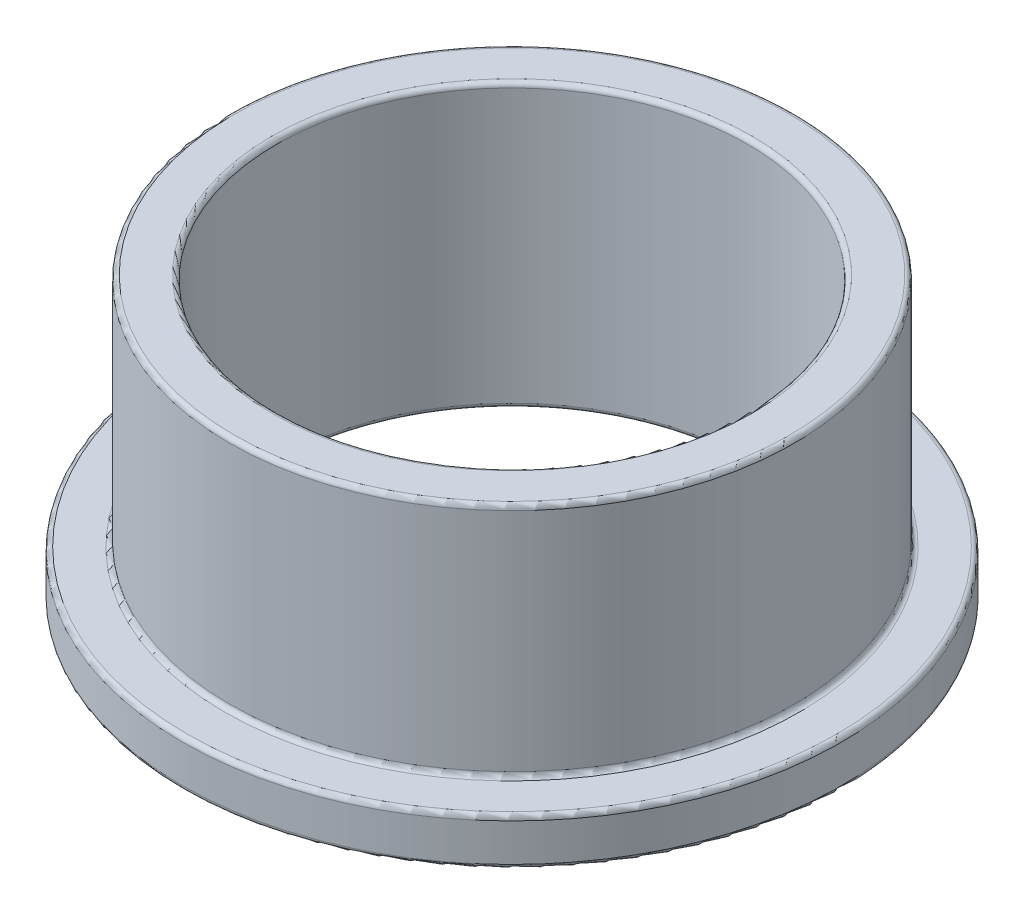
ISO-10303-21;
HEADER;
FILE_DESCRIPTION(('STEP AP214'),'2;1');
FILE_NAME('part.step','',(''),(''),'','','');
FILE_SCHEMA(('AUTOMOTIVE_DESIGN { 1 0 10303 214 1 1 1 1 }'));
ENDSEC;
DATA;
#1=APPLICATION_CONTEXT('core data for automotive mechanical design processes');
#2=APPLICATION_PROTOCOL_DEFINITION('international standard','automotive_design',2000,#1);
#3=PRODUCT_CONTEXT('',#1,'mechanical');
#4=PRODUCT('Part','Part','',(#3));
#5=PRODUCT_RELATED_PRODUCT_CATEGORY('part','',(#4));
#6=PRODUCT_DEFINITION_FORMATION('','',#4);
#7=PRODUCT_DEFINITION_CONTEXT('part definition',#1,'design');
#8=PRODUCT_DEFINITION('design','',#6,#7);
#9=PRODUCT_DEFINITION_SHAPE('','',#8);
#10=(LENGTH_UNIT() NAMED_UNIT(*) SI_UNIT(.MILLI.,.METRE.));
#11=(NAMED_UNIT(*) PLANE_ANGLE_UNIT() SI_UNIT($,.RADIAN.));
#12=(NAMED_UNIT(*) SI_UNIT($,.STERADIAN.) SOLID_ANGLE_UNIT());
#13=UNCERTAINTY_MEASURE_WITH_UNIT(LENGTH_MEASURE(1.E-05),#10,'distance_accuracy_value','');
#14=(GEOMETRIC_REPRESENTATION_CONTEXT(3) GLOBAL_UNCERTAINTY_ASSIGNED_CONTEXT((#13)) GLOBAL_UNIT_ASSIGNED_CONTEXT((#10,
#11,#12)) REPRESENTATION_CONTEXT('',''));
#15=CARTESIAN_POINT('',(0.,0.,0.));
#16=DIRECTION('',(0.,0.,1.));
#17=DIRECTION('',(1.,0.,0.));
#18=AXIS2_PLACEMENT_3D('',#15,#16,#17);
#19=CARTESIAN_POINT('',(0.,6.,0.));
#20=DIRECTION('',(0.,1.,0.));
#21=DIRECTION('',(0.,0.,1.));
#22=AXIS2_PLACEMENT_3D('',#19,#20,#21);
#23=PLANE('',#22);
#24=CARTESIAN_POINT('',(0.,6.,0.));
#25=DIRECTION('',(0.,1.,0.));
#26=DIRECTION('',(0.,0.,1.));
#27=AXIS2_PLACEMENT_3D('',#24,#25,#26);
#28=CIRCLE('',#27,5.1);
#29=CARTESIAN_POINT('',(0.,6.,5.1));
#30=VERTEX_POINT('',#29);
#31=EDGE_CURVE('E10',#30,#30,#28,.F.);
#32=ORIENTED_EDGE('',*,*,#31,.T.);
#33=EDGE_LOOP('',(#32));
#34=FACE_BOUND('',#33,.T.);
#35=CARTESIAN_POINT('',(0.,6.,0.));
#36=DIRECTION('',(0.,1.,0.));
#37=DIRECTION('',(0.,0.,1.));
#38=AXIS2_PLACEMENT_3D('',#35,#36,#37);
#39=CIRCLE('',#38,5.9);
#40=CARTESIAN_POINT('',(0.,6.,5.9));
#41=VERTEX_POINT('',#40);
#42=EDGE_CURVE('E42',#41,#41,#39,.T.);
#43=ORIENTED_EDGE('',*,*,#42,.T.);
#44=EDGE_LOOP('',(#43));
#45=FACE_BOUND('',#44,.T.);
#46=ADVANCED_FACE('F35',(#34,#45),#23,.T.);
#47=CARTESIAN_POINT('',(0.,0.,0.));
#48=DIRECTION('',(0.,1.,0.));
#49=DIRECTION('',(0.,0.,1.));
#50=AXIS2_PLACEMENT_3D('',#47,#48,#49);
#51=PLANE('',#50);
#52=CARTESIAN_POINT('',(0.,0.,0.));
#53=DIRECTION('',(0.,1.,0.));
#54=DIRECTION('',(0.,0.,1.));
#55=AXIS2_PLACEMENT_3D('',#52,#53,#54);
#56=CIRCLE('',#55,5.1);
#57=CARTESIAN_POINT('',(0.,0.,5.1));
#58=VERTEX_POINT('',#57);
#59=EDGE_CURVE('E73',#58,#58,#56,.T.);
#60=ORIENTED_EDGE('',*,*,#59,.T.);
#61=EDGE_LOOP('',(#60));
#62=FACE_BOUND('',#61,.T.);
#63=CARTESIAN_POINT('',(0.,0.,0.));
#64=DIRECTION('',(0.,1.,0.));
#65=DIRECTION('',(0.,0.,1.));
#66=AXIS2_PLACEMENT_3D('',#63,#64,#65);
#67=CIRCLE('',#66,6.9);
#68=CARTESIAN_POINT('',(0.,0.,6.9));
#69=VERTEX_POINT('',#68);
#70=EDGE_CURVE('E76',#69,#69,#67,.F.);
#71=ORIENTED_EDGE('',*,*,#70,.T.);
#72=EDGE_LOOP('',(#71));
#73=FACE_BOUND('',#72,.T.);
#74=ADVANCED_FACE('F80',(#62,#73),#51,.F.);
#75=CARTESIAN_POINT('',(0.,6.,0.));
#76=DIRECTION('',(0.,-1.,0.));
#77=DIRECTION('',(0.,0.,-1.));
#78=AXIS2_PLACEMENT_3D('',#75,#76,#77);
#79=CYLINDRICAL_SURFACE('',#78,6.);
#80=CARTESIAN_POINT('',(0.,1.1,0.));
#81=DIRECTION('',(0.,1.,0.));
#82=DIRECTION('',(0.,0.,1.));
#83=AXIS2_PLACEMENT_3D('',#80,#81,#82);
#84=CIRCLE('',#83,6.);
#85=CARTESIAN_POINT('',(0.,1.1,6.));
#86=VERTEX_POINT('',#85);
#87=EDGE_CURVE('E55',#86,#86,#84,.T.);
#88=ORIENTED_EDGE('',*,*,#87,.T.);
#89=EDGE_LOOP('',(#88));
#90=FACE_BOUND('',#89,.T.);
#91=CARTESIAN_POINT('',(0.,5.9,0.));
#92=DIRECTION('',(0.,1.,0.));
#93=DIRECTION('',(0.,0.,1.));
#94=AXIS2_PLACEMENT_3D('',#91,#92,#93);
#95=CIRCLE('',#94,6.);
#96=CARTESIAN_POINT('',(0.,5.9,6.));
#97=VERTEX_POINT('',#96);
#98=EDGE_CURVE('E58',#97,#97,#95,.F.);
#99=ORIENTED_EDGE('',*,*,#98,.T.);
#100=EDGE_LOOP('',(#99));
#101=FACE_BOUND('',#100,.T.);
#102=ADVANCED_FACE('F111',(#90,#101),#79,.T.);
#103=CARTESIAN_POINT('',(0.,6.,0.));
#104=DIRECTION('',(0.,-1.,0.));
#105=DIRECTION('',(0.,0.,-1.));
#106=AXIS2_PLACEMENT_3D('',#103,#104,#105);
#107=CYLINDRICAL_SURFACE('',#106,5.);
#108=CARTESIAN_POINT('',(0.,0.1,0.));
#109=DIRECTION('',(0.,1.,0.));
#110=DIRECTION('',(0.,0.,1.));
#111=AXIS2_PLACEMENT_3D('',#108,#109,#110);
#112=CIRCLE('',#111,5.);
#113=CARTESIAN_POINT('',(0.,0.1,5.));
#114=VERTEX_POINT('',#113);
#115=EDGE_CURVE('E67',#114,#114,#112,.F.);
#116=ORIENTED_EDGE('',*,*,#115,.T.);
#117=EDGE_LOOP('',(#116));
#118=FACE_BOUND('',#117,.T.);
#119=CARTESIAN_POINT('',(0.,5.9,0.));
#120=DIRECTION('',(0.,1.,0.));
#121=DIRECTION('',(0.,0.,1.));
#122=AXIS2_PLACEMENT_3D('',#119,#120,#121);
#123=CIRCLE('',#122,5.);
#124=CARTESIAN_POINT('',(0.,5.9,5.));
#125=VERTEX_POINT('',#124);
#126=EDGE_CURVE('E70',#125,#125,#123,.T.);
#127=ORIENTED_EDGE('',*,*,#126,.T.);
#128=EDGE_LOOP('',(#127));
#129=FACE_BOUND('',#128,.T.);
#130=ADVANCED_FACE('F105',(#118,#129),#107,.F.);
#131=CARTESIAN_POINT('',(0.,1.,0.));
#132=DIRECTION('',(0.,1.,0.));
#133=DIRECTION('',(0.,0.,1.));
#134=AXIS2_PLACEMENT_3D('',#131,#132,#133);
#135=PLANE('',#134);
#136=CARTESIAN_POINT('',(0.,1.,0.));
#137=DIRECTION('',(0.,1.,0.));
#138=DIRECTION('',(0.,0.,1.));
#139=AXIS2_PLACEMENT_3D('',#136,#137,#138);
#140=CIRCLE('',#139,6.1);
#141=CARTESIAN_POINT('',(0.,1.,6.1));
#142=VERTEX_POINT('',#141);
#143=EDGE_CURVE('E46',#142,#142,#140,.F.);
#144=ORIENTED_EDGE('',*,*,#143,.T.);
#145=EDGE_LOOP('',(#144));
#146=FACE_BOUND('',#145,.T.);
#147=CARTESIAN_POINT('',(0.,1.,0.));
#148=DIRECTION('',(0.,1.,0.));
#149=DIRECTION('',(0.,0.,1.));
#150=AXIS2_PLACEMENT_3D('',#147,#148,#149);
#151=CIRCLE('',#150,6.9);
#152=CARTESIAN_POINT('',(0.,1.,6.9));
#153=VERTEX_POINT('',#152);
#154=EDGE_CURVE('E50',#153,#153,#151,.T.);
#155=ORIENTED_EDGE('',*,*,#154,.T.);
#156=EDGE_LOOP('',(#155));
#157=FACE_BOUND('',#156,.T.);
#158=ADVANCED_FACE('F93',(#146,#157),#135,.T.);
#159=CARTESIAN_POINT('',(0.,1.,0.));
#160=DIRECTION('',(0.,-1.,0.));
#161=DIRECTION('',(0.,0.,-1.));
#162=AXIS2_PLACEMENT_3D('',#159,#160,#161);
#163=CYLINDRICAL_SURFACE('',#162,7.);
#164=CARTESIAN_POINT('',(0.,0.1,0.));
#165=DIRECTION('',(0.,1.,0.));
#166=DIRECTION('',(0.,0.,1.));
#167=AXIS2_PLACEMENT_3D('',#164,#165,#166);
#168=CIRCLE('',#167,7.);
#169=CARTESIAN_POINT('',(0.,0.1,7.));
#170=VERTEX_POINT('',#169);
#171=EDGE_CURVE('E61',#170,#170,#168,.T.);
#172=ORIENTED_EDGE('',*,*,#171,.T.);
#173=EDGE_LOOP('',(#172));
#174=FACE_BOUND('',#173,.T.);
#175=CARTESIAN_POINT('',(0.,0.9,0.));
#176=DIRECTION('',(0.,1.,0.));
#177=DIRECTION('',(0.,0.,1.));
#178=AXIS2_PLACEMENT_3D('',#175,#176,#177);
#179=CIRCLE('',#178,7.);
#180=CARTESIAN_POINT('',(0.,0.9,7.));
#181=VERTEX_POINT('',#180);
#182=EDGE_CURVE('E64',#181,#181,#179,.F.);
#183=ORIENTED_EDGE('',*,*,#182,.T.);
#184=EDGE_LOOP('',(#183));
#185=FACE_BOUND('',#184,.T.);
#186=ADVANCED_FACE('F90',(#174,#185),#163,.T.);
#187=CARTESIAN_POINT('',(0.,0.1,0.));
#188=DIRECTION('',(0.,1.,0.));
#189=DIRECTION('',(0.,0.,1.));
#190=AXIS2_PLACEMENT_3D('',#187,#188,#189);
#191=TOROIDAL_SURFACE('',#190,5.1,0.1);
#192=ORIENTED_EDGE('',*,*,#115,.F.);
#193=EDGE_LOOP('',(#192));
#194=FACE_BOUND('',#193,.T.);
#195=ORIENTED_EDGE('',*,*,#59,.F.);
#196=EDGE_LOOP('',(#195));
#197=FACE_BOUND('',#196,.T.);
#198=ADVANCED_FACE('F86',(#194,#197),#191,.T.);
#199=CARTESIAN_POINT('',(0.,0.1,0.));
#200=DIRECTION('',(0.,1.,0.));
#201=DIRECTION('',(0.,0.,1.));
#202=AXIS2_PLACEMENT_3D('',#199,#200,#201);
#203=TOROIDAL_SURFACE('',#202,6.9,0.1);
#204=ORIENTED_EDGE('',*,*,#70,.F.);
#205=EDGE_LOOP('',(#204));
#206=FACE_BOUND('',#205,.T.);
#207=ORIENTED_EDGE('',*,*,#171,.F.);
#208=EDGE_LOOP('',(#207));
#209=FACE_BOUND('',#208,.T.);
#210=ADVANCED_FACE('F82',(#206,#209),#203,.T.);
#211=CARTESIAN_POINT('',(0.,1.1,0.));
#212=DIRECTION('',(0.,1.,0.));
#213=DIRECTION('',(0.,0.,1.));
#214=AXIS2_PLACEMENT_3D('',#211,#212,#213);
#215=TOROIDAL_SURFACE('',#214,6.1,0.1);
#216=ORIENTED_EDGE('',*,*,#143,.F.);
#217=EDGE_LOOP('',(#216));
#218=FACE_BOUND('',#217,.T.);
#219=ORIENTED_EDGE('',*,*,#87,.F.);
#220=EDGE_LOOP('',(#219));
#221=FACE_BOUND('',#220,.T.);
#222=ADVANCED_FACE('F85',(#218,#221),#215,.F.);
#223=CARTESIAN_POINT('',(0.,0.9,0.));
#224=DIRECTION('',(0.,1.,0.));
#225=DIRECTION('',(0.,0.,1.));
#226=AXIS2_PLACEMENT_3D('',#223,#224,#225);
#227=TOROIDAL_SURFACE('',#226,6.9,0.1);
#228=ORIENTED_EDGE('',*,*,#182,.F.);
#229=EDGE_LOOP('',(#228));
#230=FACE_BOUND('',#229,.T.);
#231=ORIENTED_EDGE('',*,*,#154,.F.);
#232=EDGE_LOOP('',(#231));
#233=FACE_BOUND('',#232,.T.);
#234=ADVANCED_FACE('F97',(#230,#233),#227,.T.);
#235=CARTESIAN_POINT('',(0.,5.9,0.));
#236=DIRECTION('',(0.,1.,0.));
#237=DIRECTION('',(0.,0.,1.));
#238=AXIS2_PLACEMENT_3D('',#235,#236,#237);
#239=TOROIDAL_SURFACE('',#238,5.1,0.1);
#240=ORIENTED_EDGE('',*,*,#31,.F.);
#241=EDGE_LOOP('',(#240));
#242=FACE_BOUND('',#241,.T.);
#243=ORIENTED_EDGE('',*,*,#126,.F.);
#244=EDGE_LOOP('',(#243));
#245=FACE_BOUND('',#244,.T.);
#246=ADVANCED_FACE('F100',(#242,#245),#239,.T.);
#247=CARTESIAN_POINT('',(0.,5.9,0.));
#248=DIRECTION('',(0.,1.,0.));
#249=DIRECTION('',(0.,0.,1.));
#250=AXIS2_PLACEMENT_3D('',#247,#248,#249);
#251=TOROIDAL_SURFACE('',#250,5.9,0.1);
#252=ORIENTED_EDGE('',*,*,#98,.F.);
#253=EDGE_LOOP('',(#252));
#254=FACE_BOUND('',#253,.T.);
#255=ORIENTED_EDGE('',*,*,#42,.F.);
#256=EDGE_LOOP('',(#255));
#257=FACE_BOUND('',#256,.T.);
#258=ADVANCED_FACE('F37',(#254,#257),#251,.T.);
#259=CLOSED_SHELL('',(#46,#74,#102,#130,#158,#186,#198,#210,#222,#234,#246,#258));
#260=MANIFOLD_SOLID_BREP('B2',#259);
#261=ADVANCED_BREP_SHAPE_REPRESENTATION('',(#18,#260),#14);
#262=SHAPE_DEFINITION_REPRESENTATION(#9,#261);
ENDSEC;
END-ISO-10303-21;
